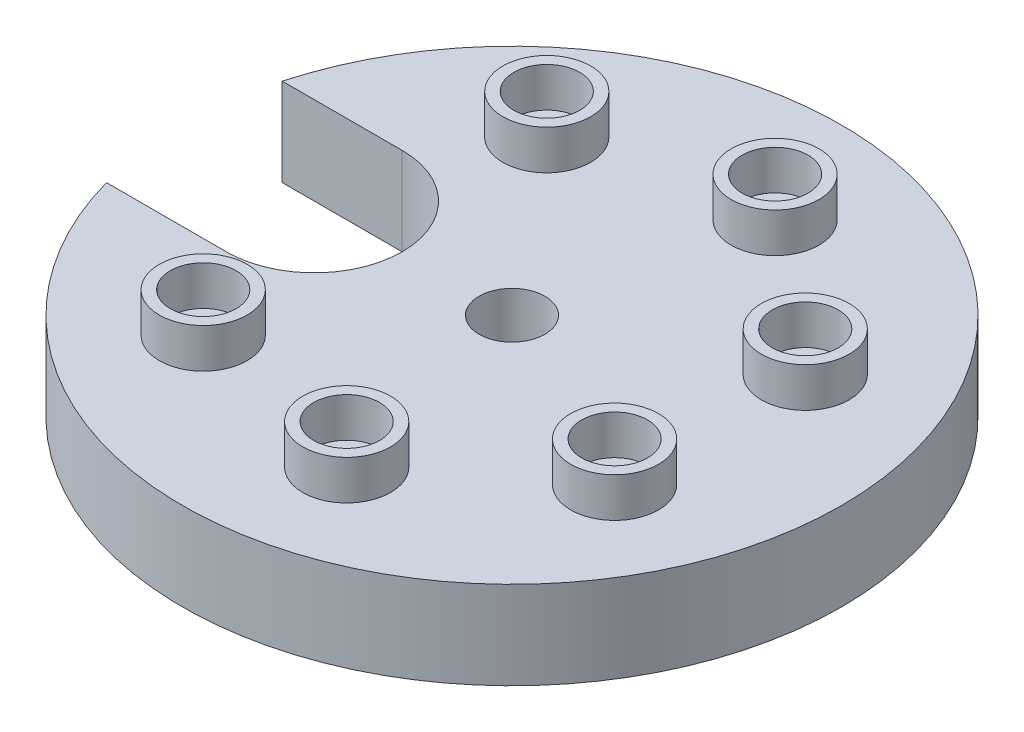
ISO-10303-21;
HEADER;
FILE_DESCRIPTION(('STEP AP214'),'2;1');
FILE_NAME('part.step','',(''),(''),'','','');
FILE_SCHEMA(('AUTOMOTIVE_DESIGN { 1 0 10303 214 1 1 1 1 }'));
ENDSEC;
DATA;
#1=APPLICATION_CONTEXT('core data for automotive mechanical design processes');
#2=APPLICATION_PROTOCOL_DEFINITION('international standard','automotive_design',2000,#1);
#3=PRODUCT_CONTEXT('',#1,'mechanical');
#4=PRODUCT('Part','Part','',(#3));
#5=PRODUCT_RELATED_PRODUCT_CATEGORY('part','',(#4));
#6=PRODUCT_DEFINITION_FORMATION('','',#4);
#7=PRODUCT_DEFINITION_CONTEXT('part definition',#1,'design');
#8=PRODUCT_DEFINITION('design','',#6,#7);
#9=PRODUCT_DEFINITION_SHAPE('','',#8);
#10=(LENGTH_UNIT() NAMED_UNIT(*) SI_UNIT(.MILLI.,.METRE.));
#11=(NAMED_UNIT(*) PLANE_ANGLE_UNIT() SI_UNIT($,.RADIAN.));
#12=(NAMED_UNIT(*) SI_UNIT($,.STERADIAN.) SOLID_ANGLE_UNIT());
#13=UNCERTAINTY_MEASURE_WITH_UNIT(LENGTH_MEASURE(1.E-05),#10,'distance_accuracy_value','');
#14=(GEOMETRIC_REPRESENTATION_CONTEXT(3) GLOBAL_UNCERTAINTY_ASSIGNED_CONTEXT((#13)) GLOBAL_UNIT_ASSIGNED_CONTEXT((#10,
#11,#12)) REPRESENTATION_CONTEXT('',''));
#15=CARTESIAN_POINT('',(0.,0.,0.));
#16=DIRECTION('',(0.,0.,1.));
#17=DIRECTION('',(1.,0.,0.));
#18=AXIS2_PLACEMENT_3D('',#15,#16,#17);
#19=CARTESIAN_POINT('',(0.,20.,0.));
#20=DIRECTION('',(0.,-1.,0.));
#21=DIRECTION('',(0.,0.,-1.));
#22=AXIS2_PLACEMENT_3D('',#19,#20,#21);
#23=CYLINDRICAL_SURFACE('',#22,75.);
#24=CARTESIAN_POINT('',(0.,0.,0.));
#25=DIRECTION('',(0.,1.,0.));
#26=DIRECTION('',(0.,0.,1.));
#27=AXIS2_PLACEMENT_3D('',#24,#25,#26);
#28=CIRCLE('',#27,75.);
#29=CARTESIAN_POINT('',(-72.2841614740048,0.,20.));
#30=VERTEX_POINT('',#29);
#31=CARTESIAN_POINT('',(-72.2841614740048,0.,-20.));
#32=VERTEX_POINT('',#31);
#33=EDGE_CURVE('E147',#30,#32,#28,.T.);
#34=ORIENTED_EDGE('',*,*,#33,.T.);
#35=DIRECTION('',(0.,-1.,0.));
#36=VECTOR('',#35,1.);
#37=CARTESIAN_POINT('',(-72.2841614740048,20.,-20.));
#38=LINE('',#37,#36);
#39=CARTESIAN_POINT('',(-72.2841614740048,20.,-20.));
#40=VERTEX_POINT('',#39);
#41=EDGE_CURVE('E148',#32,#40,#38,.F.);
#42=ORIENTED_EDGE('',*,*,#41,.T.);
#43=CARTESIAN_POINT('',(0.,20.,0.));
#44=DIRECTION('',(0.,1.,0.));
#45=DIRECTION('',(0.,0.,1.));
#46=AXIS2_PLACEMENT_3D('',#43,#44,#45);
#47=CIRCLE('',#46,75.);
#48=CARTESIAN_POINT('',(-72.2841614740048,20.,20.));
#49=VERTEX_POINT('',#48);
#50=EDGE_CURVE('E99',#49,#40,#47,.T.);
#51=ORIENTED_EDGE('',*,*,#50,.F.);
#52=DIRECTION('',(0.,-1.,0.));
#53=VECTOR('',#52,1.);
#54=CARTESIAN_POINT('',(-72.2841614740048,20.,20.));
#55=LINE('',#54,#53);
#56=EDGE_CURVE('E73',#49,#30,#55,.T.);
#57=ORIENTED_EDGE('',*,*,#56,.T.);
#58=EDGE_LOOP('',(#34,#42,#51,#57));
#59=FACE_BOUND('',#58,.T.);
#60=ADVANCED_FACE('F32',(#59),#23,.T.);
#61=CARTESIAN_POINT('',(0.,20.,0.));
#62=DIRECTION('',(0.,1.,0.));
#63=DIRECTION('',(0.,0.,1.));
#64=AXIS2_PLACEMENT_3D('',#61,#62,#63);
#65=PLANE('',#64);
#66=DIRECTION('',(-1.,0.,0.));
#67=VECTOR('',#66,1.);
#68=CARTESIAN_POINT('',(-96.6404369646424,20.,-20.));
#69=LINE('',#68,#67);
#70=CARTESIAN_POINT('',(-45.,20.,-20.));
#71=VERTEX_POINT('',#70);
#72=EDGE_CURVE('E78',#71,#40,#69,.T.);
#73=ORIENTED_EDGE('',*,*,#72,.F.);
#74=CARTESIAN_POINT('',(-45.,20.,0.));
#75=DIRECTION('',(0.,1.,0.));
#76=DIRECTION('',(0.,0.,-1.));
#77=AXIS2_PLACEMENT_3D('',#74,#75,#76);
#78=CIRCLE('',#77,20.);
#79=CARTESIAN_POINT('',(-45.,20.,20.));
#80=VERTEX_POINT('',#79);
#81=EDGE_CURVE('E42',#80,#71,#78,.T.);
#82=ORIENTED_EDGE('',*,*,#81,.F.);
#83=DIRECTION('',(1.,0.,0.));
#84=VECTOR('',#83,1.);
#85=CARTESIAN_POINT('',(-96.6404369646424,20.,20.));
#86=LINE('',#85,#84);
#87=EDGE_CURVE('E69',#49,#80,#86,.T.);
#88=ORIENTED_EDGE('',*,*,#87,.F.);
#89=ORIENTED_EDGE('',*,*,#50,.T.);
#90=EDGE_LOOP('',(#73,#82,#88,#89));
#91=FACE_BOUND('',#90,.T.);
#92=CARTESIAN_POINT('',(0.,20.,0.));
#93=DIRECTION('',(0.,1.,0.));
#94=DIRECTION('',(0.,0.,1.));
#95=AXIS2_PLACEMENT_3D('',#92,#93,#94);
#96=CIRCLE('',#95,7.5);
#97=CARTESIAN_POINT('',(0.,20.,7.5));
#98=VERTEX_POINT('',#97);
#99=EDGE_CURVE('E105',#98,#98,#96,.T.);
#100=ORIENTED_EDGE('',*,*,#99,.F.);
#101=EDGE_LOOP('',(#100));
#102=FACE_BOUND('',#101,.T.);
#103=CARTESIAN_POINT('',(-31.1744900929372,20.,39.0915741234011));
#104=DIRECTION('',(0.,1.,0.));
#105=DIRECTION('',(0.,0.,1.));
#106=AXIS2_PLACEMENT_3D('',#103,#104,#105);
#107=CIRCLE('',#106,10.);
#108=CARTESIAN_POINT('',(-31.1744900929372,20.,49.0915741234011));
#109=VERTEX_POINT('',#108);
#110=EDGE_CURVE('E119',#109,#109,#107,.T.);
#111=ORIENTED_EDGE('',*,*,#110,.F.);
#112=EDGE_LOOP('',(#111));
#113=FACE_BOUND('',#112,.T.);
#114=CARTESIAN_POINT('',(11.1260466978153,20.,48.7463956090913));
#115=DIRECTION('',(0.,1.,0.));
#116=DIRECTION('',(0.,0.,1.));
#117=AXIS2_PLACEMENT_3D('',#114,#115,#116);
#118=CIRCLE('',#117,10.);
#119=CARTESIAN_POINT('',(11.1260466978153,20.,58.7463956090913));
#120=VERTEX_POINT('',#119);
#121=EDGE_CURVE('E178',#120,#120,#118,.T.);
#122=ORIENTED_EDGE('',*,*,#121,.F.);
#123=EDGE_LOOP('',(#122));
#124=FACE_BOUND('',#123,.T.);
#125=CARTESIAN_POINT('',(45.0484433951208,20.,21.6941869558783));
#126=DIRECTION('',(0.,1.,0.));
#127=DIRECTION('',(0.,0.,1.));
#128=AXIS2_PLACEMENT_3D('',#125,#126,#127);
#129=CIRCLE('',#128,10.);
#130=CARTESIAN_POINT('',(45.0484433951208,20.,31.6941869558783));
#131=VERTEX_POINT('',#130);
#132=EDGE_CURVE('E171',#131,#131,#129,.T.);
#133=ORIENTED_EDGE('',*,*,#132,.F.);
#134=EDGE_LOOP('',(#133));
#135=FACE_BOUND('',#134,.T.);
#136=CARTESIAN_POINT('',(45.0484433951211,20.,-21.6941869558776));
#137=DIRECTION('',(0.,1.,0.));
#138=DIRECTION('',(0.,0.,1.));
#139=AXIS2_PLACEMENT_3D('',#136,#137,#138);
#140=CIRCLE('',#139,10.);
#141=CARTESIAN_POINT('',(45.0484433951211,20.,-11.6941869558776));
#142=VERTEX_POINT('',#141);
#143=EDGE_CURVE('E164',#142,#142,#140,.T.);
#144=ORIENTED_EDGE('',*,*,#143,.F.);
#145=EDGE_LOOP('',(#144));
#146=FACE_BOUND('',#145,.T.);
#147=CARTESIAN_POINT('',(11.1260466978159,20.,-48.7463956090911));
#148=DIRECTION('',(0.,1.,0.));
#149=DIRECTION('',(0.,0.,1.));
#150=AXIS2_PLACEMENT_3D('',#147,#148,#149);
#151=CIRCLE('',#150,10.);
#152=CARTESIAN_POINT('',(11.1260466978159,20.,-38.7463956090911));
#153=VERTEX_POINT('',#152);
#154=EDGE_CURVE('E157',#153,#153,#151,.T.);
#155=ORIENTED_EDGE('',*,*,#154,.F.);
#156=EDGE_LOOP('',(#155));
#157=FACE_BOUND('',#156,.T.);
#158=CARTESIAN_POINT('',(-31.1744900929366,20.,-39.0915741234016));
#159=DIRECTION('',(0.,1.,0.));
#160=DIRECTION('',(0.,0.,1.));
#161=AXIS2_PLACEMENT_3D('',#158,#159,#160);
#162=CIRCLE('',#161,10.);
#163=CARTESIAN_POINT('',(-31.1744900929366,20.,-29.0915741234016));
#164=VERTEX_POINT('',#163);
#165=EDGE_CURVE('E150',#164,#164,#162,.T.);
#166=ORIENTED_EDGE('',*,*,#165,.F.);
#167=EDGE_LOOP('',(#166));
#168=FACE_BOUND('',#167,.T.);
#169=ADVANCED_FACE('F83',(#91,#102,#113,#124,#135,#146,#157,#168),#65,.T.);
#170=CARTESIAN_POINT('',(0.,0.,0.));
#171=DIRECTION('',(0.,1.,0.));
#172=DIRECTION('',(0.,0.,1.));
#173=AXIS2_PLACEMENT_3D('',#170,#171,#172);
#174=PLANE('',#173);
#175=CARTESIAN_POINT('',(0.,0.,0.));
#176=DIRECTION('',(0.,1.,0.));
#177=DIRECTION('',(0.,0.,1.));
#178=AXIS2_PLACEMENT_3D('',#175,#176,#177);
#179=CIRCLE('',#178,7.5);
#180=CARTESIAN_POINT('',(0.,0.,7.5));
#181=VERTEX_POINT('',#180);
#182=EDGE_CURVE('E97',#181,#181,#179,.T.);
#183=ORIENTED_EDGE('',*,*,#182,.T.);
#184=EDGE_LOOP('',(#183));
#185=FACE_BOUND('',#184,.T.);
#186=CARTESIAN_POINT('',(-45.,0.,0.));
#187=DIRECTION('',(0.,1.,0.));
#188=DIRECTION('',(0.,0.,-1.));
#189=AXIS2_PLACEMENT_3D('',#186,#187,#188);
#190=CIRCLE('',#189,20.);
#191=CARTESIAN_POINT('',(-45.,0.,20.));
#192=VERTEX_POINT('',#191);
#193=CARTESIAN_POINT('',(-45.,0.,-20.));
#194=VERTEX_POINT('',#193);
#195=EDGE_CURVE('E36',#192,#194,#190,.T.);
#196=ORIENTED_EDGE('',*,*,#195,.T.);
#197=DIRECTION('',(-1.,0.,0.));
#198=VECTOR('',#197,1.);
#199=CARTESIAN_POINT('',(-96.6404369646424,0.,-20.));
#200=LINE('',#199,#198);
#201=EDGE_CURVE('E88',#194,#32,#200,.T.);
#202=ORIENTED_EDGE('',*,*,#201,.T.);
#203=ORIENTED_EDGE('',*,*,#33,.F.);
#204=DIRECTION('',(1.,0.,0.));
#205=VECTOR('',#204,1.);
#206=CARTESIAN_POINT('',(0.,0.,20.));
#207=LINE('',#206,#205);
#208=EDGE_CURVE('E90',#30,#192,#207,.T.);
#209=ORIENTED_EDGE('',*,*,#208,.T.);
#210=EDGE_LOOP('',(#196,#202,#203,#209));
#211=FACE_BOUND('',#210,.T.);
#212=ADVANCED_FACE('F191',(#185,#211),#174,.F.);
#213=CARTESIAN_POINT('',(-31.1744900929366,29.,-39.0915741234016));
#214=DIRECTION('',(0.,1.,0.));
#215=DIRECTION('',(0.,0.,1.));
#216=AXIS2_PLACEMENT_3D('',#213,#214,#215);
#217=PLANE('',#216);
#218=CARTESIAN_POINT('',(-31.1744900929366,29.,-39.0915741234016));
#219=DIRECTION('',(0.,1.,0.));
#220=DIRECTION('',(0.,0.,1.));
#221=AXIS2_PLACEMENT_3D('',#218,#219,#220);
#222=CIRCLE('',#221,10.);
#223=CARTESIAN_POINT('',(-31.1744900929366,29.,-29.0915741234016));
#224=VERTEX_POINT('',#223);
#225=EDGE_CURVE('E95',#224,#224,#222,.T.);
#226=ORIENTED_EDGE('',*,*,#225,.T.);
#227=EDGE_LOOP('',(#226));
#228=FACE_BOUND('',#227,.T.);
#229=CARTESIAN_POINT('',(-31.1744900929366,29.,-39.0915741234016));
#230=DIRECTION('',(0.,1.,0.));
#231=DIRECTION('',(0.,0.,1.));
#232=AXIS2_PLACEMENT_3D('',#229,#230,#231);
#233=CIRCLE('',#232,7.5);
#234=CARTESIAN_POINT('',(-31.1744900929366,29.,-31.5915741234016));
#235=VERTEX_POINT('',#234);
#236=EDGE_CURVE('E146',#235,#235,#233,.T.);
#237=ORIENTED_EDGE('',*,*,#236,.F.);
#238=EDGE_LOOP('',(#237));
#239=FACE_BOUND('',#238,.T.);
#240=ADVANCED_FACE('F193',(#228,#239),#217,.T.);
#241=CARTESIAN_POINT('',(-31.1744900929366,29.,-39.0915741234016));
#242=DIRECTION('',(0.,-1.,0.));
#243=DIRECTION('',(0.,0.,-1.));
#244=AXIS2_PLACEMENT_3D('',#241,#242,#243);
#245=CYLINDRICAL_SURFACE('',#244,10.);
#246=ORIENTED_EDGE('',*,*,#225,.F.);
#247=EDGE_LOOP('',(#246));
#248=FACE_BOUND('',#247,.T.);
#249=ORIENTED_EDGE('',*,*,#165,.T.);
#250=EDGE_LOOP('',(#249));
#251=FACE_BOUND('',#250,.T.);
#252=ADVANCED_FACE('F199',(#248,#251),#245,.T.);
#253=CARTESIAN_POINT('',(-31.1744900929366,29.,-39.0915741234016));
#254=DIRECTION('',(0.,-1.,0.));
#255=DIRECTION('',(0.,0.,-1.));
#256=AXIS2_PLACEMENT_3D('',#253,#254,#255);
#257=CYLINDRICAL_SURFACE('',#256,7.5);
#258=ORIENTED_EDGE('',*,*,#236,.T.);
#259=EDGE_LOOP('',(#258));
#260=FACE_BOUND('',#259,.T.);
#261=CARTESIAN_POINT('',(-31.1744900929366,20.,-39.0915741234016));
#262=DIRECTION('',(0.,1.,0.));
#263=DIRECTION('',(0.,0.,1.));
#264=AXIS2_PLACEMENT_3D('',#261,#262,#263);
#265=CIRCLE('',#264,7.5);
#266=CARTESIAN_POINT('',(-31.1744900929366,20.,-31.5915741234016));
#267=VERTEX_POINT('',#266);
#268=EDGE_CURVE('E142',#267,#267,#265,.F.);
#269=ORIENTED_EDGE('',*,*,#268,.T.);
#270=EDGE_LOOP('',(#269));
#271=FACE_BOUND('',#270,.T.);
#272=ADVANCED_FACE('F232',(#260,#271),#257,.F.);
#273=ORIENTED_EDGE('',*,*,#268,.F.);
#274=EDGE_LOOP('',(#273));
#275=FACE_BOUND('',#274,.T.);
#276=ADVANCED_FACE('F204',(#275),#65,.T.);
#277=CARTESIAN_POINT('',(11.1260466978159,29.,-48.7463956090911));
#278=DIRECTION('',(0.,1.,0.));
#279=DIRECTION('',(0.,0.,1.));
#280=AXIS2_PLACEMENT_3D('',#277,#278,#279);
#281=PLANE('',#280);
#282=CARTESIAN_POINT('',(11.1260466978159,29.,-48.7463956090911));
#283=DIRECTION('',(0.,1.,0.));
#284=DIRECTION('',(0.,0.,1.));
#285=AXIS2_PLACEMENT_3D('',#282,#283,#284);
#286=CIRCLE('',#285,10.);
#287=CARTESIAN_POINT('',(11.1260466978159,29.,-38.7463956090911));
#288=VERTEX_POINT('',#287);
#289=EDGE_CURVE('E145',#288,#288,#286,.T.);
#290=ORIENTED_EDGE('',*,*,#289,.T.);
#291=EDGE_LOOP('',(#290));
#292=FACE_BOUND('',#291,.T.);
#293=CARTESIAN_POINT('',(11.1260466978159,29.,-48.7463956090911));
#294=DIRECTION('',(0.,1.,0.));
#295=DIRECTION('',(0.,0.,1.));
#296=AXIS2_PLACEMENT_3D('',#293,#294,#295);
#297=CIRCLE('',#296,7.5);
#298=CARTESIAN_POINT('',(11.1260466978159,29.,-41.2463956090911));
#299=VERTEX_POINT('',#298);
#300=EDGE_CURVE('E141',#299,#299,#297,.T.);
#301=ORIENTED_EDGE('',*,*,#300,.F.);
#302=EDGE_LOOP('',(#301));
#303=FACE_BOUND('',#302,.T.);
#304=ADVANCED_FACE('F251',(#292,#303),#281,.T.);
#305=CARTESIAN_POINT('',(11.1260466978159,29.,-48.7463956090911));
#306=DIRECTION('',(0.,-1.,0.));
#307=DIRECTION('',(0.,0.,-1.));
#308=AXIS2_PLACEMENT_3D('',#305,#306,#307);
#309=CYLINDRICAL_SURFACE('',#308,10.);
#310=ORIENTED_EDGE('',*,*,#289,.F.);
#311=EDGE_LOOP('',(#310));
#312=FACE_BOUND('',#311,.T.);
#313=ORIENTED_EDGE('',*,*,#154,.T.);
#314=EDGE_LOOP('',(#313));
#315=FACE_BOUND('',#314,.T.);
#316=ADVANCED_FACE('F261',(#312,#315),#309,.T.);
#317=CARTESIAN_POINT('',(11.1260466978159,29.,-48.7463956090911));
#318=DIRECTION('',(0.,-1.,0.));
#319=DIRECTION('',(0.,0.,-1.));
#320=AXIS2_PLACEMENT_3D('',#317,#318,#319);
#321=CYLINDRICAL_SURFACE('',#320,7.5);
#322=ORIENTED_EDGE('',*,*,#300,.T.);
#323=EDGE_LOOP('',(#322));
#324=FACE_BOUND('',#323,.T.);
#325=CARTESIAN_POINT('',(11.1260466978159,20.,-48.7463956090911));
#326=DIRECTION('',(0.,1.,0.));
#327=DIRECTION('',(0.,0.,1.));
#328=AXIS2_PLACEMENT_3D('',#325,#326,#327);
#329=CIRCLE('',#328,7.5);
#330=CARTESIAN_POINT('',(11.1260466978159,20.,-41.2463956090911));
#331=VERTEX_POINT('',#330);
#332=EDGE_CURVE('E137',#331,#331,#329,.F.);
#333=ORIENTED_EDGE('',*,*,#332,.T.);
#334=EDGE_LOOP('',(#333));
#335=FACE_BOUND('',#334,.T.);
#336=ADVANCED_FACE('F271',(#324,#335),#321,.F.);
#337=ORIENTED_EDGE('',*,*,#332,.F.);
#338=EDGE_LOOP('',(#337));
#339=FACE_BOUND('',#338,.T.);
#340=ADVANCED_FACE('F253',(#339),#65,.T.);
#341=CARTESIAN_POINT('',(45.0484433951211,29.,-21.6941869558776));
#342=DIRECTION('',(0.,1.,0.));
#343=DIRECTION('',(0.,0.,1.));
#344=AXIS2_PLACEMENT_3D('',#341,#342,#343);
#345=PLANE('',#344);
#346=CARTESIAN_POINT('',(45.0484433951211,29.,-21.6941869558776));
#347=DIRECTION('',(0.,1.,0.));
#348=DIRECTION('',(0.,0.,1.));
#349=AXIS2_PLACEMENT_3D('',#346,#347,#348);
#350=CIRCLE('',#349,10.);
#351=CARTESIAN_POINT('',(45.0484433951211,29.,-11.6941869558776));
#352=VERTEX_POINT('',#351);
#353=EDGE_CURVE('E140',#352,#352,#350,.T.);
#354=ORIENTED_EDGE('',*,*,#353,.T.);
#355=EDGE_LOOP('',(#354));
#356=FACE_BOUND('',#355,.T.);
#357=CARTESIAN_POINT('',(45.0484433951211,29.,-21.6941869558776));
#358=DIRECTION('',(0.,1.,0.));
#359=DIRECTION('',(0.,0.,1.));
#360=AXIS2_PLACEMENT_3D('',#357,#358,#359);
#361=CIRCLE('',#360,7.5);
#362=CARTESIAN_POINT('',(45.0484433951211,29.,-14.1941869558776));
#363=VERTEX_POINT('',#362);
#364=EDGE_CURVE('E136',#363,#363,#361,.T.);
#365=ORIENTED_EDGE('',*,*,#364,.F.);
#366=EDGE_LOOP('',(#365));
#367=FACE_BOUND('',#366,.T.);
#368=ADVANCED_FACE('F290',(#356,#367),#345,.T.);
#369=CARTESIAN_POINT('',(45.0484433951211,29.,-21.6941869558776));
#370=DIRECTION('',(0.,-1.,0.));
#371=DIRECTION('',(0.,0.,-1.));
#372=AXIS2_PLACEMENT_3D('',#369,#370,#371);
#373=CYLINDRICAL_SURFACE('',#372,10.);
#374=ORIENTED_EDGE('',*,*,#353,.F.);
#375=EDGE_LOOP('',(#374));
#376=FACE_BOUND('',#375,.T.);
#377=ORIENTED_EDGE('',*,*,#143,.T.);
#378=EDGE_LOOP('',(#377));
#379=FACE_BOUND('',#378,.T.);
#380=ADVANCED_FACE('F300',(#376,#379),#373,.T.);
#381=CARTESIAN_POINT('',(45.0484433951211,29.,-21.6941869558776));
#382=DIRECTION('',(0.,-1.,0.));
#383=DIRECTION('',(0.,0.,-1.));
#384=AXIS2_PLACEMENT_3D('',#381,#382,#383);
#385=CYLINDRICAL_SURFACE('',#384,7.5);
#386=ORIENTED_EDGE('',*,*,#364,.T.);
#387=EDGE_LOOP('',(#386));
#388=FACE_BOUND('',#387,.T.);
#389=CARTESIAN_POINT('',(45.0484433951211,20.,-21.6941869558776));
#390=DIRECTION('',(0.,1.,0.));
#391=DIRECTION('',(0.,0.,1.));
#392=AXIS2_PLACEMENT_3D('',#389,#390,#391);
#393=CIRCLE('',#392,7.5);
#394=CARTESIAN_POINT('',(45.0484433951211,20.,-14.1941869558776));
#395=VERTEX_POINT('',#394);
#396=EDGE_CURVE('E132',#395,#395,#393,.F.);
#397=ORIENTED_EDGE('',*,*,#396,.T.);
#398=EDGE_LOOP('',(#397));
#399=FACE_BOUND('',#398,.T.);
#400=ADVANCED_FACE('F310',(#388,#399),#385,.F.);
#401=ORIENTED_EDGE('',*,*,#396,.F.);
#402=EDGE_LOOP('',(#401));
#403=FACE_BOUND('',#402,.T.);
#404=ADVANCED_FACE('F292',(#403),#65,.T.);
#405=CARTESIAN_POINT('',(45.0484433951208,29.,21.6941869558783));
#406=DIRECTION('',(0.,1.,0.));
#407=DIRECTION('',(0.,0.,1.));
#408=AXIS2_PLACEMENT_3D('',#405,#406,#407);
#409=PLANE('',#408);
#410=CARTESIAN_POINT('',(45.0484433951208,29.,21.6941869558783));
#411=DIRECTION('',(0.,1.,0.));
#412=DIRECTION('',(0.,0.,1.));
#413=AXIS2_PLACEMENT_3D('',#410,#411,#412);
#414=CIRCLE('',#413,10.);
#415=CARTESIAN_POINT('',(45.0484433951208,29.,31.6941869558783));
#416=VERTEX_POINT('',#415);
#417=EDGE_CURVE('E135',#416,#416,#414,.T.);
#418=ORIENTED_EDGE('',*,*,#417,.T.);
#419=EDGE_LOOP('',(#418));
#420=FACE_BOUND('',#419,.T.);
#421=CARTESIAN_POINT('',(45.0484433951208,29.,21.6941869558783));
#422=DIRECTION('',(0.,1.,0.));
#423=DIRECTION('',(0.,0.,1.));
#424=AXIS2_PLACEMENT_3D('',#421,#422,#423);
#425=CIRCLE('',#424,7.5);
#426=CARTESIAN_POINT('',(45.0484433951208,29.,29.1941869558783));
#427=VERTEX_POINT('',#426);
#428=EDGE_CURVE('E131',#427,#427,#425,.T.);
#429=ORIENTED_EDGE('',*,*,#428,.F.);
#430=EDGE_LOOP('',(#429));
#431=FACE_BOUND('',#430,.T.);
#432=ADVANCED_FACE('F329',(#420,#431),#409,.T.);
#433=CARTESIAN_POINT('',(45.0484433951208,29.,21.6941869558783));
#434=DIRECTION('',(0.,-1.,0.));
#435=DIRECTION('',(0.,0.,-1.));
#436=AXIS2_PLACEMENT_3D('',#433,#434,#435);
#437=CYLINDRICAL_SURFACE('',#436,10.);
#438=ORIENTED_EDGE('',*,*,#417,.F.);
#439=EDGE_LOOP('',(#438));
#440=FACE_BOUND('',#439,.T.);
#441=ORIENTED_EDGE('',*,*,#132,.T.);
#442=EDGE_LOOP('',(#441));
#443=FACE_BOUND('',#442,.T.);
#444=ADVANCED_FACE('F339',(#440,#443),#437,.T.);
#445=CARTESIAN_POINT('',(45.0484433951208,29.,21.6941869558783));
#446=DIRECTION('',(0.,-1.,0.));
#447=DIRECTION('',(0.,0.,-1.));
#448=AXIS2_PLACEMENT_3D('',#445,#446,#447);
#449=CYLINDRICAL_SURFACE('',#448,7.5);
#450=ORIENTED_EDGE('',*,*,#428,.T.);
#451=EDGE_LOOP('',(#450));
#452=FACE_BOUND('',#451,.T.);
#453=CARTESIAN_POINT('',(45.0484433951208,20.,21.6941869558783));
#454=DIRECTION('',(0.,1.,0.));
#455=DIRECTION('',(0.,0.,1.));
#456=AXIS2_PLACEMENT_3D('',#453,#454,#455);
#457=CIRCLE('',#456,7.5);
#458=CARTESIAN_POINT('',(45.0484433951208,20.,29.1941869558783));
#459=VERTEX_POINT('',#458);
#460=EDGE_CURVE('E127',#459,#459,#457,.F.);
#461=ORIENTED_EDGE('',*,*,#460,.T.);
#462=EDGE_LOOP('',(#461));
#463=FACE_BOUND('',#462,.T.);
#464=ADVANCED_FACE('F349',(#452,#463),#449,.F.);
#465=ORIENTED_EDGE('',*,*,#460,.F.);
#466=EDGE_LOOP('',(#465));
#467=FACE_BOUND('',#466,.T.);
#468=ADVANCED_FACE('F331',(#467),#65,.T.);
#469=CARTESIAN_POINT('',(11.1260466978153,29.,48.7463956090913));
#470=DIRECTION('',(0.,1.,0.));
#471=DIRECTION('',(0.,0.,1.));
#472=AXIS2_PLACEMENT_3D('',#469,#470,#471);
#473=PLANE('',#472);
#474=CARTESIAN_POINT('',(11.1260466978153,29.,48.7463956090913));
#475=DIRECTION('',(0.,1.,0.));
#476=DIRECTION('',(0.,0.,1.));
#477=AXIS2_PLACEMENT_3D('',#474,#475,#476);
#478=CIRCLE('',#477,10.);
#479=CARTESIAN_POINT('',(11.1260466978153,29.,58.7463956090913));
#480=VERTEX_POINT('',#479);
#481=EDGE_CURVE('E130',#480,#480,#478,.T.);
#482=ORIENTED_EDGE('',*,*,#481,.T.);
#483=EDGE_LOOP('',(#482));
#484=FACE_BOUND('',#483,.T.);
#485=CARTESIAN_POINT('',(11.1260466978153,29.,48.7463956090913));
#486=DIRECTION('',(0.,1.,0.));
#487=DIRECTION('',(0.,0.,1.));
#488=AXIS2_PLACEMENT_3D('',#485,#486,#487);
#489=CIRCLE('',#488,7.5);
#490=CARTESIAN_POINT('',(11.1260466978153,29.,56.2463956090913));
#491=VERTEX_POINT('',#490);
#492=EDGE_CURVE('E126',#491,#491,#489,.T.);
#493=ORIENTED_EDGE('',*,*,#492,.F.);
#494=EDGE_LOOP('',(#493));
#495=FACE_BOUND('',#494,.T.);
#496=ADVANCED_FACE('F368',(#484,#495),#473,.T.);
#497=CARTESIAN_POINT('',(11.1260466978153,29.,48.7463956090913));
#498=DIRECTION('',(0.,-1.,0.));
#499=DIRECTION('',(0.,0.,-1.));
#500=AXIS2_PLACEMENT_3D('',#497,#498,#499);
#501=CYLINDRICAL_SURFACE('',#500,10.);
#502=ORIENTED_EDGE('',*,*,#481,.F.);
#503=EDGE_LOOP('',(#502));
#504=FACE_BOUND('',#503,.T.);
#505=ORIENTED_EDGE('',*,*,#121,.T.);
#506=EDGE_LOOP('',(#505));
#507=FACE_BOUND('',#506,.T.);
#508=ADVANCED_FACE('F378',(#504,#507),#501,.T.);
#509=CARTESIAN_POINT('',(11.1260466978153,29.,48.7463956090913));
#510=DIRECTION('',(0.,-1.,0.));
#511=DIRECTION('',(0.,0.,-1.));
#512=AXIS2_PLACEMENT_3D('',#509,#510,#511);
#513=CYLINDRICAL_SURFACE('',#512,7.5);
#514=ORIENTED_EDGE('',*,*,#492,.T.);
#515=EDGE_LOOP('',(#514));
#516=FACE_BOUND('',#515,.T.);
#517=CARTESIAN_POINT('',(11.1260466978153,20.,48.7463956090913));
#518=DIRECTION('',(0.,1.,0.));
#519=DIRECTION('',(0.,0.,1.));
#520=AXIS2_PLACEMENT_3D('',#517,#518,#519);
#521=CIRCLE('',#520,7.5);
#522=CARTESIAN_POINT('',(11.1260466978153,20.,56.2463956090913));
#523=VERTEX_POINT('',#522);
#524=EDGE_CURVE('E122',#523,#523,#521,.F.);
#525=ORIENTED_EDGE('',*,*,#524,.T.);
#526=EDGE_LOOP('',(#525));
#527=FACE_BOUND('',#526,.T.);
#528=ADVANCED_FACE('F388',(#516,#527),#513,.F.);
#529=ORIENTED_EDGE('',*,*,#524,.F.);
#530=EDGE_LOOP('',(#529));
#531=FACE_BOUND('',#530,.T.);
#532=ADVANCED_FACE('F370',(#531),#65,.T.);
#533=CARTESIAN_POINT('',(-31.1744900929372,29.,39.0915741234011));
#534=DIRECTION('',(0.,1.,0.));
#535=DIRECTION('',(0.,0.,1.));
#536=AXIS2_PLACEMENT_3D('',#533,#534,#535);
#537=PLANE('',#536);
#538=CARTESIAN_POINT('',(-31.1744900929372,29.,39.0915741234011));
#539=DIRECTION('',(0.,1.,0.));
#540=DIRECTION('',(0.,0.,1.));
#541=AXIS2_PLACEMENT_3D('',#538,#539,#540);
#542=CIRCLE('',#541,10.);
#543=CARTESIAN_POINT('',(-31.1744900929372,29.,49.0915741234011));
#544=VERTEX_POINT('',#543);
#545=EDGE_CURVE('E125',#544,#544,#542,.T.);
#546=ORIENTED_EDGE('',*,*,#545,.T.);
#547=EDGE_LOOP('',(#546));
#548=FACE_BOUND('',#547,.T.);
#549=CARTESIAN_POINT('',(-31.1744900929372,29.,39.0915741234011));
#550=DIRECTION('',(0.,1.,0.));
#551=DIRECTION('',(0.,0.,1.));
#552=AXIS2_PLACEMENT_3D('',#549,#550,#551);
#553=CIRCLE('',#552,7.5);
#554=CARTESIAN_POINT('',(-31.1744900929372,29.,46.5915741234011));
#555=VERTEX_POINT('',#554);
#556=EDGE_CURVE('E114',#555,#555,#553,.T.);
#557=ORIENTED_EDGE('',*,*,#556,.F.);
#558=EDGE_LOOP('',(#557));
#559=FACE_BOUND('',#558,.T.);
#560=ADVANCED_FACE('F407',(#548,#559),#537,.T.);
#561=CARTESIAN_POINT('',(-31.1744900929372,29.,39.0915741234011));
#562=DIRECTION('',(0.,-1.,0.));
#563=DIRECTION('',(0.,0.,-1.));
#564=AXIS2_PLACEMENT_3D('',#561,#562,#563);
#565=CYLINDRICAL_SURFACE('',#564,10.);
#566=ORIENTED_EDGE('',*,*,#545,.F.);
#567=EDGE_LOOP('',(#566));
#568=FACE_BOUND('',#567,.T.);
#569=ORIENTED_EDGE('',*,*,#110,.T.);
#570=EDGE_LOOP('',(#569));
#571=FACE_BOUND('',#570,.T.);
#572=ADVANCED_FACE('F416',(#568,#571),#565,.T.);
#573=CARTESIAN_POINT('',(-31.1744900929372,29.,39.0915741234011));
#574=DIRECTION('',(0.,-1.,0.));
#575=DIRECTION('',(0.,0.,-1.));
#576=AXIS2_PLACEMENT_3D('',#573,#574,#575);
#577=CYLINDRICAL_SURFACE('',#576,7.5);
#578=ORIENTED_EDGE('',*,*,#556,.T.);
#579=EDGE_LOOP('',(#578));
#580=FACE_BOUND('',#579,.T.);
#581=CARTESIAN_POINT('',(-31.1744900929372,20.,39.0915741234011));
#582=DIRECTION('',(0.,1.,0.));
#583=DIRECTION('',(0.,0.,1.));
#584=AXIS2_PLACEMENT_3D('',#581,#582,#583);
#585=CIRCLE('',#584,7.5);
#586=CARTESIAN_POINT('',(-31.1744900929372,20.,46.5915741234011));
#587=VERTEX_POINT('',#586);
#588=EDGE_CURVE('E110',#587,#587,#585,.F.);
#589=ORIENTED_EDGE('',*,*,#588,.T.);
#590=EDGE_LOOP('',(#589));
#591=FACE_BOUND('',#590,.T.);
#592=ADVANCED_FACE('F426',(#580,#591),#577,.F.);
#593=ORIENTED_EDGE('',*,*,#588,.F.);
#594=EDGE_LOOP('',(#593));
#595=FACE_BOUND('',#594,.T.);
#596=ADVANCED_FACE('F203',(#595),#65,.T.);
#597=CARTESIAN_POINT('',(0.,0.,0.));
#598=DIRECTION('',(0.,1.,0.));
#599=DIRECTION('',(0.,0.,1.));
#600=AXIS2_PLACEMENT_3D('',#597,#598,#599);
#601=CYLINDRICAL_SURFACE('',#600,7.5);
#602=ORIENTED_EDGE('',*,*,#182,.F.);
#603=EDGE_LOOP('',(#602));
#604=FACE_BOUND('',#603,.T.);
#605=ORIENTED_EDGE('',*,*,#99,.T.);
#606=EDGE_LOOP('',(#605));
#607=FACE_BOUND('',#606,.T.);
#608=ADVANCED_FACE('F445',(#604,#607),#601,.F.);
#609=CARTESIAN_POINT('',(-96.6404369646424,0.,-20.));
#610=DIRECTION('',(0.,0.,-1.));
#611=DIRECTION('',(-1.,0.,0.));
#612=AXIS2_PLACEMENT_3D('',#609,#610,#611);
#613=PLANE('',#612);
#614=ORIENTED_EDGE('',*,*,#201,.F.);
#615=DIRECTION('',(0.,1.,0.));
#616=VECTOR('',#615,1.);
#617=CARTESIAN_POINT('',(-45.,0.,-20.));
#618=LINE('',#617,#616);
#619=EDGE_CURVE('E107',#194,#71,#618,.T.);
#620=ORIENTED_EDGE('',*,*,#619,.T.);
#621=ORIENTED_EDGE('',*,*,#72,.T.);
#622=ORIENTED_EDGE('',*,*,#41,.F.);
#623=EDGE_LOOP('',(#614,#620,#621,#622));
#624=FACE_BOUND('',#623,.T.);
#625=ADVANCED_FACE('F34',(#624),#613,.F.);
#626=CARTESIAN_POINT('',(-96.6404369646424,0.,20.));
#627=DIRECTION('',(0.,0.,1.));
#628=DIRECTION('',(1.,0.,0.));
#629=AXIS2_PLACEMENT_3D('',#626,#627,#628);
#630=PLANE('',#629);
#631=ORIENTED_EDGE('',*,*,#87,.T.);
#632=DIRECTION('',(0.,1.,0.));
#633=VECTOR('',#632,1.);
#634=CARTESIAN_POINT('',(-45.,0.,20.));
#635=LINE('',#634,#633);
#636=EDGE_CURVE('E11',#192,#80,#635,.T.);
#637=ORIENTED_EDGE('',*,*,#636,.F.);
#638=ORIENTED_EDGE('',*,*,#208,.F.);
#639=ORIENTED_EDGE('',*,*,#56,.F.);
#640=EDGE_LOOP('',(#631,#637,#638,#639));
#641=FACE_BOUND('',#640,.T.);
#642=ADVANCED_FACE('F70',(#641),#630,.F.);
#643=CARTESIAN_POINT('',(-45.,0.,0.));
#644=DIRECTION('',(0.,1.,0.));
#645=DIRECTION('',(0.,0.,1.));
#646=AXIS2_PLACEMENT_3D('',#643,#644,#645);
#647=CYLINDRICAL_SURFACE('',#646,20.);
#648=ORIENTED_EDGE('',*,*,#81,.T.);
#649=ORIENTED_EDGE('',*,*,#619,.F.);
#650=ORIENTED_EDGE('',*,*,#195,.F.);
#651=ORIENTED_EDGE('',*,*,#636,.T.);
#652=EDGE_LOOP('',(#648,#649,#650,#651));
#653=FACE_BOUND('',#652,.T.);
#654=ADVANCED_FACE('F81',(#653),#647,.F.);
#655=CLOSED_SHELL('',(#60,#169,#212,#240,#252,#272,#276,#304,#316,#336,#340,#368,#380,#400,#404,
#432,#444,#464,#468,#496,#508,#528,#532,#560,#572,#592,#596,#608,#625,#642,#654));
#656=MANIFOLD_SOLID_BREP('B2',#655);
#657=ADVANCED_BREP_SHAPE_REPRESENTATION('',(#18,#656),#14);
#658=SHAPE_DEFINITION_REPRESENTATION(#9,#657);
ENDSEC;
END-ISO-10303-21;
